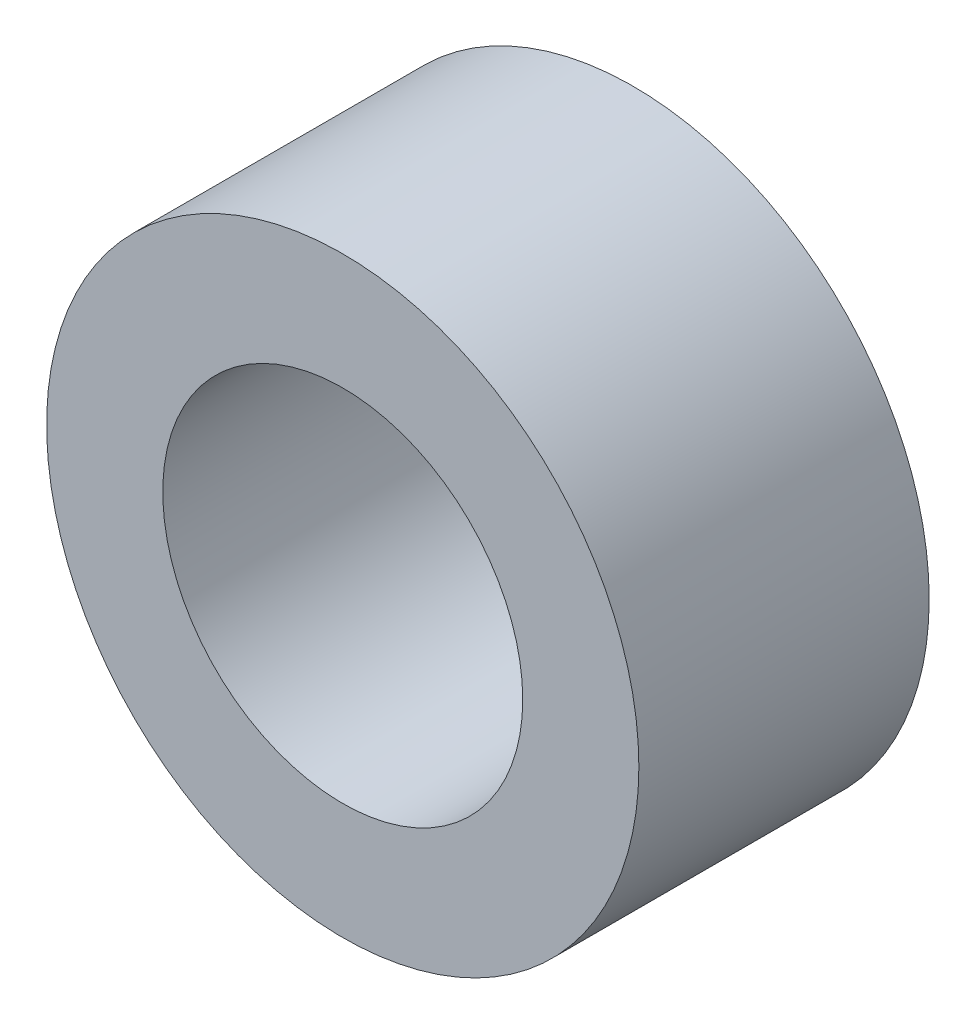
ISO-10303-21;
HEADER;
FILE_DESCRIPTION(('STEP AP214'),'2;1');
FILE_NAME('part.step','',(''),(''),'','','');
FILE_SCHEMA(('AUTOMOTIVE_DESIGN { 1 0 10303 214 1 1 1 1 }'));
ENDSEC;
DATA;
#1=APPLICATION_CONTEXT('core data for automotive mechanical design processes');
#2=APPLICATION_PROTOCOL_DEFINITION('international standard','automotive_design',2000,#1);
#3=PRODUCT_CONTEXT('',#1,'mechanical');
#4=PRODUCT('Part','Part','',(#3));
#5=PRODUCT_RELATED_PRODUCT_CATEGORY('part','',(#4));
#6=PRODUCT_DEFINITION_FORMATION('','',#4);
#7=PRODUCT_DEFINITION_CONTEXT('part definition',#1,'design');
#8=PRODUCT_DEFINITION('design','',#6,#7);
#9=PRODUCT_DEFINITION_SHAPE('','',#8);
#10=(LENGTH_UNIT() NAMED_UNIT(*) SI_UNIT(.MILLI.,.METRE.));
#11=(NAMED_UNIT(*) PLANE_ANGLE_UNIT() SI_UNIT($,.RADIAN.));
#12=(NAMED_UNIT(*) SI_UNIT($,.STERADIAN.) SOLID_ANGLE_UNIT());
#13=UNCERTAINTY_MEASURE_WITH_UNIT(LENGTH_MEASURE(1.E-05),#10,'distance_accuracy_value','');
#14=(GEOMETRIC_REPRESENTATION_CONTEXT(3) GLOBAL_UNCERTAINTY_ASSIGNED_CONTEXT((#13)) GLOBAL_UNIT_ASSIGNED_CONTEXT((#10,
#11,#12)) REPRESENTATION_CONTEXT('',''));
#15=CARTESIAN_POINT('',(0.,0.,0.));
#16=DIRECTION('',(0.,0.,1.));
#17=DIRECTION('',(1.,0.,0.));
#18=AXIS2_PLACEMENT_3D('',#15,#16,#17);
#19=CARTESIAN_POINT('',(0.,0.,10.));
#20=DIRECTION('',(0.,0.,1.));
#21=DIRECTION('',(1.,0.,0.));
#22=AXIS2_PLACEMENT_3D('',#19,#20,#21);
#23=PLANE('',#22);
#24=CARTESIAN_POINT('',(0.,0.,10.));
#25=DIRECTION('',(0.,0.,1.));
#26=DIRECTION('',(1.,0.,0.));
#27=AXIS2_PLACEMENT_3D('',#24,#25,#26);
#28=CIRCLE('',#27,10.2);
#29=CARTESIAN_POINT('',(10.2,0.,10.));
#30=VERTEX_POINT('',#29);
#31=EDGE_CURVE('E10',#30,#30,#28,.T.);
#32=ORIENTED_EDGE('',*,*,#31,.T.);
#33=EDGE_LOOP('',(#32));
#34=FACE_BOUND('',#33,.T.);
#35=CARTESIAN_POINT('',(0.,0.,10.));
#36=DIRECTION('',(0.,0.,1.));
#37=DIRECTION('',(1.,0.,0.));
#38=AXIS2_PLACEMENT_3D('',#35,#36,#37);
#39=CIRCLE('',#38,6.2);
#40=CARTESIAN_POINT('',(6.2,0.,10.));
#41=VERTEX_POINT('',#40);
#42=EDGE_CURVE('E56',#41,#41,#39,.T.);
#43=ORIENTED_EDGE('',*,*,#42,.F.);
#44=EDGE_LOOP('',(#43));
#45=FACE_BOUND('',#44,.T.);
#46=ADVANCED_FACE('F43',(#34,#45),#23,.T.);
#47=CARTESIAN_POINT('',(0.,0.,0.));
#48=DIRECTION('',(0.,0.,1.));
#49=DIRECTION('',(1.,0.,0.));
#50=AXIS2_PLACEMENT_3D('',#47,#48,#49);
#51=PLANE('',#50);
#52=CARTESIAN_POINT('',(0.,0.,0.));
#53=DIRECTION('',(0.,0.,1.));
#54=DIRECTION('',(1.,0.,0.));
#55=AXIS2_PLACEMENT_3D('',#52,#53,#54);
#56=CIRCLE('',#55,10.2);
#57=CARTESIAN_POINT('',(10.2,0.,0.));
#58=VERTEX_POINT('',#57);
#59=EDGE_CURVE('E47',#58,#58,#56,.T.);
#60=ORIENTED_EDGE('',*,*,#59,.F.);
#61=EDGE_LOOP('',(#60));
#62=FACE_BOUND('',#61,.T.);
#63=CARTESIAN_POINT('',(0.,0.,0.));
#64=DIRECTION('',(0.,0.,1.));
#65=DIRECTION('',(1.,0.,0.));
#66=AXIS2_PLACEMENT_3D('',#63,#64,#65);
#67=CIRCLE('',#66,6.2);
#68=CARTESIAN_POINT('',(6.2,0.,0.));
#69=VERTEX_POINT('',#68);
#70=EDGE_CURVE('E58',#69,#69,#67,.T.);
#71=ORIENTED_EDGE('',*,*,#70,.T.);
#72=EDGE_LOOP('',(#71));
#73=FACE_BOUND('',#72,.T.);
#74=ADVANCED_FACE('F70',(#62,#73),#51,.F.);
#75=CARTESIAN_POINT('',(0.,0.,10.));
#76=DIRECTION('',(0.,0.,-1.));
#77=DIRECTION('',(-1.,0.,0.));
#78=AXIS2_PLACEMENT_3D('',#75,#76,#77);
#79=CYLINDRICAL_SURFACE('',#78,10.2);
#80=ORIENTED_EDGE('',*,*,#31,.F.);
#81=EDGE_LOOP('',(#80));
#82=FACE_BOUND('',#81,.T.);
#83=ORIENTED_EDGE('',*,*,#59,.T.);
#84=EDGE_LOOP('',(#83));
#85=FACE_BOUND('',#84,.T.);
#86=ADVANCED_FACE('F45',(#82,#85),#79,.T.);
#87=CARTESIAN_POINT('',(0.,0.,10.));
#88=DIRECTION('',(0.,0.,-1.));
#89=DIRECTION('',(-1.,0.,0.));
#90=AXIS2_PLACEMENT_3D('',#87,#88,#89);
#91=CYLINDRICAL_SURFACE('',#90,6.2);
#92=ORIENTED_EDGE('',*,*,#42,.T.);
#93=EDGE_LOOP('',(#92));
#94=FACE_BOUND('',#93,.T.);
#95=ORIENTED_EDGE('',*,*,#70,.F.);
#96=EDGE_LOOP('',(#95));
#97=FACE_BOUND('',#96,.T.);
#98=ADVANCED_FACE('F66',(#94,#97),#91,.F.);
#99=CLOSED_SHELL('',(#46,#74,#86,#98));
#100=MANIFOLD_SOLID_BREP('B2',#99);
#101=ADVANCED_BREP_SHAPE_REPRESENTATION('',(#18,#100),#14);
#102=SHAPE_DEFINITION_REPRESENTATION(#9,#101);
ENDSEC;
END-ISO-10303-21;
